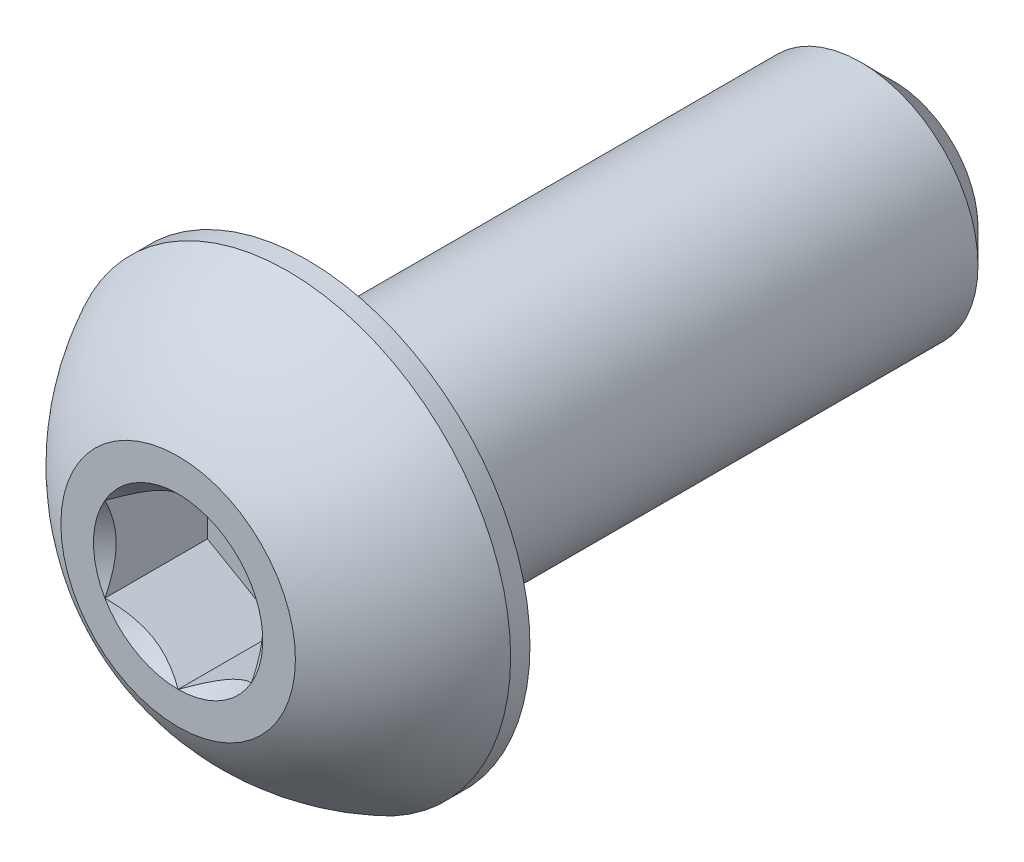
ISO-10303-21;
HEADER;
FILE_DESCRIPTION(('STEP AP214'),'2;1');
FILE_NAME('part.step','',(''),(''),'','','');
FILE_SCHEMA(('AUTOMOTIVE_DESIGN { 1 0 10303 214 1 1 1 1 }'));
ENDSEC;
DATA;
#1=APPLICATION_CONTEXT('core data for automotive mechanical design processes');
#2=APPLICATION_PROTOCOL_DEFINITION('international standard','automotive_design',2000,#1);
#3=PRODUCT_CONTEXT('',#1,'mechanical');
#4=PRODUCT('Part','Part','',(#3));
#5=PRODUCT_RELATED_PRODUCT_CATEGORY('part','',(#4));
#6=PRODUCT_DEFINITION_FORMATION('','',#4);
#7=PRODUCT_DEFINITION_CONTEXT('part definition',#1,'design');
#8=PRODUCT_DEFINITION('design','',#6,#7);
#9=PRODUCT_DEFINITION_SHAPE('','',#8);
#10=(LENGTH_UNIT() NAMED_UNIT(*) SI_UNIT(.MILLI.,.METRE.));
#11=(NAMED_UNIT(*) PLANE_ANGLE_UNIT() SI_UNIT($,.RADIAN.));
#12=(NAMED_UNIT(*) SI_UNIT($,.STERADIAN.) SOLID_ANGLE_UNIT());
#13=UNCERTAINTY_MEASURE_WITH_UNIT(LENGTH_MEASURE(1.E-05),#10,'distance_accuracy_value','');
#14=(GEOMETRIC_REPRESENTATION_CONTEXT(3) GLOBAL_UNCERTAINTY_ASSIGNED_CONTEXT((#13)) GLOBAL_UNIT_ASSIGNED_CONTEXT((#10,
#11,#12)) REPRESENTATION_CONTEXT('',''));
#15=CARTESIAN_POINT('',(0.,0.,0.));
#16=DIRECTION('',(0.,0.,1.));
#17=DIRECTION('',(1.,0.,0.));
#18=AXIS2_PLACEMENT_3D('',#15,#16,#17);
#19=CARTESIAN_POINT('',(0.,0.,-6.1));
#20=DIRECTION('',(0.,0.,1.));
#21=DIRECTION('',(0.,-1.,0.));
#22=AXIS2_PLACEMENT_3D('',#19,#20,#21);
#23=PLANE('',#22);
#24=CARTESIAN_POINT('',(0.,0.,-6.1));
#25=DIRECTION('',(0.,0.,1.));
#26=DIRECTION('',(0.,-1.,0.));
#27=AXIS2_PLACEMENT_3D('',#24,#25,#26);
#28=CIRCLE('',#27,1.44);
#29=CARTESIAN_POINT('',(0.,-1.44,-6.1));
#30=VERTEX_POINT('',#29);
#31=EDGE_CURVE('E11',#30,#30,#28,.T.);
#32=ORIENTED_EDGE('',*,*,#31,.F.);
#33=EDGE_LOOP('',(#32));
#34=FACE_BOUND('',#33,.T.);
#35=ADVANCED_FACE('F16',(#34),#23,.F.);
#36=CARTESIAN_POINT('',(0.,0.,-6.1));
#37=DIRECTION('',(0.,0.,1.));
#38=DIRECTION('',(0.,-1.,0.));
#39=AXIS2_PLACEMENT_3D('',#36,#37,#38);
#40=CONICAL_SURFACE('',#39,1.44,0.785398163397441);
#41=ORIENTED_EDGE('',*,*,#31,.T.);
#42=EDGE_LOOP('',(#41));
#43=FACE_BOUND('',#42,.T.);
#44=CARTESIAN_POINT('',(0.,0.,-5.54));
#45=DIRECTION('',(0.,0.,1.));
#46=DIRECTION('',(0.,-1.,0.));
#47=AXIS2_PLACEMENT_3D('',#44,#45,#46);
#48=CIRCLE('',#47,2.);
#49=CARTESIAN_POINT('',(0.,-2.,-5.54));
#50=VERTEX_POINT('',#49);
#51=EDGE_CURVE('E30',#50,#50,#48,.T.);
#52=ORIENTED_EDGE('',*,*,#51,.F.);
#53=EDGE_LOOP('',(#52));
#54=FACE_BOUND('',#53,.T.);
#55=ADVANCED_FACE('F266',(#43,#54),#40,.T.);
#56=CARTESIAN_POINT('',(0.,0.,6.1));
#57=DIRECTION('',(0.,0.,1.));
#58=DIRECTION('',(0.,-1.,0.));
#59=AXIS2_PLACEMENT_3D('',#56,#57,#58);
#60=CYLINDRICAL_SURFACE('',#59,2.);
#61=CARTESIAN_POINT('',(0.,0.,3.9));
#62=DIRECTION('',(0.,0.,-1.));
#63=DIRECTION('',(-1.,0.,0.));
#64=AXIS2_PLACEMENT_3D('',#61,#62,#63);
#65=CIRCLE('',#64,2.);
#66=CARTESIAN_POINT('',(-2.,0.,3.9));
#67=VERTEX_POINT('',#66);
#68=EDGE_CURVE('E150',#67,#67,#65,.T.);
#69=ORIENTED_EDGE('',*,*,#68,.T.);
#70=EDGE_LOOP('',(#69));
#71=FACE_BOUND('',#70,.T.);
#72=ORIENTED_EDGE('',*,*,#51,.T.);
#73=EDGE_LOOP('',(#72));
#74=FACE_BOUND('',#73,.T.);
#75=ADVANCED_FACE('F272',(#71,#74),#60,.T.);
#76=CARTESIAN_POINT('',(0.,-3.8,3.9));
#77=DIRECTION('',(0.,0.,-1.));
#78=DIRECTION('',(0.,-1.,0.));
#79=AXIS2_PLACEMENT_3D('',#76,#77,#78);
#80=PLANE('',#79);
#81=ORIENTED_EDGE('',*,*,#68,.F.);
#82=EDGE_LOOP('',(#81));
#83=FACE_BOUND('',#82,.T.);
#84=CARTESIAN_POINT('',(0.,0.,3.9));
#85=DIRECTION('',(0.,0.,1.));
#86=DIRECTION('',(0.,-1.,0.));
#87=AXIS2_PLACEMENT_3D('',#84,#85,#86);
#88=CIRCLE('',#87,3.8);
#89=CARTESIAN_POINT('',(0.,-3.8,3.9));
#90=VERTEX_POINT('',#89);
#91=EDGE_CURVE('E165',#90,#90,#88,.T.);
#92=ORIENTED_EDGE('',*,*,#91,.F.);
#93=EDGE_LOOP('',(#92));
#94=FACE_BOUND('',#93,.T.);
#95=ADVANCED_FACE('F443',(#83,#94),#80,.T.);
#96=CARTESIAN_POINT('',(1.25,0.721687836487032,4.35));
#97=DIRECTION('',(0.5,0.866025403784439,0.));
#98=DIRECTION('',(0.,0.,-1.));
#99=AXIS2_PLACEMENT_3D('',#96,#97,#98);
#100=PLANE('',#99);
#101=DIRECTION('',(0.,0.,1.));
#102=VECTOR('',#101,1.);
#103=CARTESIAN_POINT('',(1.25,0.721687836487032,4.35));
#104=LINE('',#103,#102);
#105=CARTESIAN_POINT('',(1.25,0.721687836487032,4.35));
#106=VERTEX_POINT('',#105);
#107=CARTESIAN_POINT('',(1.25,0.721687836487032,6.1));
#108=VERTEX_POINT('',#107);
#109=EDGE_CURVE('E172',#106,#108,#104,.T.);
#110=ORIENTED_EDGE('',*,*,#109,.T.);
#111=CARTESIAN_POINT('',(1.25,0.721687836487032,6.1));
#112=CARTESIAN_POINT('',(0.916560687278159,0.91419911344539,5.90748872304164));
#113=CARTESIAN_POINT('',(0.627302735621754,1.08120226969946,5.90662715507142));
#114=CARTESIAN_POINT('',(0.336432191070978,1.24913645689518,5.90576078391989));
#115=CARTESIAN_POINT('',(0.,1.44337567297406,6.1));
#116=B_SPLINE_CURVE_WITH_KNOTS('',2,(#111,#112,#113,#114,#115),.UNSPECIFIED.,.F.,.F.,(3,2,3),
(0.,0.5,1.),.UNSPECIFIED.);
#117=CARTESIAN_POINT('',(0.,1.44337567297406,6.1));
#118=VERTEX_POINT('',#117);
#119=EDGE_CURVE('E158',#108,#118,#116,.T.);
#120=ORIENTED_EDGE('',*,*,#119,.T.);
#121=DIRECTION('',(0.,0.,1.));
#122=VECTOR('',#121,1.);
#123=CARTESIAN_POINT('',(0.,1.44337567297406,4.35));
#124=LINE('',#123,#122);
#125=CARTESIAN_POINT('',(0.,1.44337567297406,4.35));
#126=VERTEX_POINT('',#125);
#127=EDGE_CURVE('E146',#126,#118,#124,.T.);
#128=ORIENTED_EDGE('',*,*,#127,.F.);
#129=DIRECTION('',(-0.866025403784439,0.5,0.));
#130=VECTOR('',#129,1.);
#131=CARTESIAN_POINT('',(1.25,0.721687836487032,4.35));
#132=LINE('',#131,#130);
#133=EDGE_CURVE('E141',#106,#126,#132,.T.);
#134=ORIENTED_EDGE('',*,*,#133,.F.);
#135=EDGE_LOOP('',(#110,#120,#128,#134));
#136=FACE_BOUND('',#135,.T.);
#137=ADVANCED_FACE('F18',(#136),#100,.F.);
#138=CARTESIAN_POINT('',(1.25,-0.721687836487032,4.35));
#139=DIRECTION('',(1.,0.,0.));
#140=DIRECTION('',(0.,-1.,0.));
#141=AXIS2_PLACEMENT_3D('',#138,#139,#140);
#142=PLANE('',#141);
#143=DIRECTION('',(0.,0.,1.));
#144=VECTOR('',#143,1.);
#145=CARTESIAN_POINT('',(1.25,-0.721687836487032,4.35));
#146=LINE('',#145,#144);
#147=CARTESIAN_POINT('',(1.25,-0.721687836487032,4.35));
#148=VERTEX_POINT('',#147);
#149=CARTESIAN_POINT('',(1.25,-0.721687836487033,6.1));
#150=VERTEX_POINT('',#149);
#151=EDGE_CURVE('E65',#148,#150,#146,.T.);
#152=ORIENTED_EDGE('',*,*,#151,.T.);
#153=CARTESIAN_POINT('',(1.25,-0.721687836487032,6.1));
#154=CARTESIAN_POINT('',(1.25,-0.53800867861928,6.00816042106613));
#155=CARTESIAN_POINT('',(1.25,-0.371515987727132,5.96066578692546));
#156=CARTESIAN_POINT('',(1.25,-0.182317900963498,5.90669408484771));
#157=CARTESIAN_POINT('',(1.25,7.86844095020892E-05,5.90662432950243));
#158=CARTESIAN_POINT('',(1.25,0.181409034916159,5.90655498192566));
#159=CARTESIAN_POINT('',(1.25,0.371670740916256,5.96070988390206));
#160=CARTESIAN_POINT('',(1.25,0.537520454680808,6.00791630909689));
#161=CARTESIAN_POINT('',(1.25,0.721687836487032,6.1));
#162=B_SPLINE_CURVE_WITH_KNOTS('',2,(#153,#154,#155,#156,#157,#158,#159,#160,#161),
.UNSPECIFIED.,.F.,.F.,(3,2,2,2,3),(0.,0.25,0.5,0.75,1.),.UNSPECIFIED.);
#163=EDGE_CURVE('E300',#150,#108,#162,.T.);
#164=ORIENTED_EDGE('',*,*,#163,.T.);
#165=ORIENTED_EDGE('',*,*,#109,.F.);
#166=DIRECTION('',(0.,1.,0.));
#167=VECTOR('',#166,1.);
#168=CARTESIAN_POINT('',(1.25,-0.721687836487032,4.35));
#169=LINE('',#168,#167);
#170=EDGE_CURVE('E142',#148,#106,#169,.T.);
#171=ORIENTED_EDGE('',*,*,#170,.F.);
#172=EDGE_LOOP('',(#152,#164,#165,#171));
#173=FACE_BOUND('',#172,.T.);
#174=ADVANCED_FACE('F280',(#173),#142,.F.);
#175=CARTESIAN_POINT('',(0.,-1.44337567297406,4.35));
#176=DIRECTION('',(0.5,-0.866025403784439,0.));
#177=DIRECTION('',(0.,0.,-1.));
#178=AXIS2_PLACEMENT_3D('',#175,#176,#177);
#179=PLANE('',#178);
#180=DIRECTION('',(0.,0.,1.));
#181=VECTOR('',#180,1.);
#182=CARTESIAN_POINT('',(0.,-1.44337567297406,4.35));
#183=LINE('',#182,#181);
#184=CARTESIAN_POINT('',(0.,-1.44337567297406,4.35));
#185=VERTEX_POINT('',#184);
#186=CARTESIAN_POINT('',(0.,-1.44337567297406,6.1));
#187=VERTEX_POINT('',#186);
#188=EDGE_CURVE('E82',#185,#187,#183,.T.);
#189=ORIENTED_EDGE('',*,*,#188,.T.);
#190=CARTESIAN_POINT('',(0.,-1.44337567297406,6.1));
#191=CARTESIAN_POINT('',(0.333439312720908,-1.25086439601624,5.90748872304218));
#192=CARTESIAN_POINT('',(0.622697264378245,-1.08386123976164,5.90662715507142));
#193=CARTESIAN_POINT('',(0.913567808928088,-0.915927052566456,5.90576078391935));
#194=CARTESIAN_POINT('',(1.25,-0.721687836487032,6.1));
#195=B_SPLINE_CURVE_WITH_KNOTS('',2,(#190,#191,#192,#193,#194),.UNSPECIFIED.,.F.,.F.,(3,2,3),
(0.,0.5,1.),.UNSPECIFIED.);
#196=EDGE_CURVE('E382',#187,#150,#195,.T.);
#197=ORIENTED_EDGE('',*,*,#196,.T.);
#198=ORIENTED_EDGE('',*,*,#151,.F.);
#199=DIRECTION('',(0.866025403784439,0.5,0.));
#200=VECTOR('',#199,1.);
#201=CARTESIAN_POINT('',(0.,-1.44337567297406,4.35));
#202=LINE('',#201,#200);
#203=EDGE_CURVE('E147',#185,#148,#202,.T.);
#204=ORIENTED_EDGE('',*,*,#203,.F.);
#205=EDGE_LOOP('',(#189,#197,#198,#204));
#206=FACE_BOUND('',#205,.T.);
#207=ADVANCED_FACE('F283',(#206),#179,.F.);
#208=CARTESIAN_POINT('',(-1.25,-0.721687836487032,4.35));
#209=DIRECTION('',(-0.5,-0.866025403784439,0.));
#210=DIRECTION('',(-0.866025403784439,0.5,0.));
#211=AXIS2_PLACEMENT_3D('',#208,#209,#210);
#212=PLANE('',#211);
#213=DIRECTION('',(0.,0.,1.));
#214=VECTOR('',#213,1.);
#215=CARTESIAN_POINT('',(-1.25,-0.721687836487032,4.35));
#216=LINE('',#215,#214);
#217=CARTESIAN_POINT('',(-1.25,-0.721687836487032,4.35));
#218=VERTEX_POINT('',#217);
#219=CARTESIAN_POINT('',(-1.25,-0.721687836487033,6.1));
#220=VERTEX_POINT('',#219);
#221=EDGE_CURVE('E338',#218,#220,#216,.T.);
#222=ORIENTED_EDGE('',*,*,#221,.T.);
#223=CARTESIAN_POINT('',(-1.25,-0.721687836487032,6.1));
#224=CARTESIAN_POINT('',(-0.916560687278155,-0.914199113445393,5.90748872304164));
#225=CARTESIAN_POINT('',(-0.627302735621754,-1.08120226969946,5.90662715507142));
#226=CARTESIAN_POINT('',(-0.336432191070971,-1.24913645689518,5.9057607839199));
#227=CARTESIAN_POINT('',(0.,-1.44337567297406,6.1));
#228=B_SPLINE_CURVE_WITH_KNOTS('',2,(#223,#224,#225,#226,#227),.UNSPECIFIED.,.F.,.F.,(3,2,3),
(0.,0.5,1.),.UNSPECIFIED.);
#229=EDGE_CURVE('E334',#220,#187,#228,.T.);
#230=ORIENTED_EDGE('',*,*,#229,.T.);
#231=ORIENTED_EDGE('',*,*,#188,.F.);
#232=DIRECTION('',(0.866025403784439,-0.5,0.));
#233=VECTOR('',#232,1.);
#234=CARTESIAN_POINT('',(-1.25,-0.721687836487032,4.35));
#235=LINE('',#234,#233);
#236=EDGE_CURVE('E151',#218,#185,#235,.T.);
#237=ORIENTED_EDGE('',*,*,#236,.F.);
#238=EDGE_LOOP('',(#222,#230,#231,#237));
#239=FACE_BOUND('',#238,.T.);
#240=ADVANCED_FACE('F215',(#239),#212,.F.);
#241=CARTESIAN_POINT('',(-1.25,0.721687836487033,4.35));
#242=DIRECTION('',(-1.,0.,0.));
#243=DIRECTION('',(0.,0.,1.));
#244=AXIS2_PLACEMENT_3D('',#241,#242,#243);
#245=PLANE('',#244);
#246=DIRECTION('',(0.,0.,1.));
#247=VECTOR('',#246,1.);
#248=CARTESIAN_POINT('',(-1.25,0.721687836487033,4.35));
#249=LINE('',#248,#247);
#250=CARTESIAN_POINT('',(-1.25,0.721687836487033,4.35));
#251=VERTEX_POINT('',#250);
#252=CARTESIAN_POINT('',(-1.25,0.721687836487033,6.1));
#253=VERTEX_POINT('',#252);
#254=EDGE_CURVE('E242',#251,#253,#249,.T.);
#255=ORIENTED_EDGE('',*,*,#254,.T.);
#256=CARTESIAN_POINT('',(-1.25,0.721687836487033,6.1));
#257=CARTESIAN_POINT('',(-1.25,0.538092414487825,6.0082022890004));
#258=CARTESIAN_POINT('',(-1.25,0.371670740916257,5.96070988390206));
#259=CARTESIAN_POINT('',(-1.25,0.182469151636589,5.90671668499666));
#260=CARTESIAN_POINT('',(-1.25,7.86844095019808E-05,5.90662432950243));
#261=CARTESIAN_POINT('',(-1.25,-0.18125671000327,5.90653250825636));
#262=CARTESIAN_POINT('',(-1.25,-0.371515987727133,5.96066578692546));
#263=CARTESIAN_POINT('',(-1.25,-0.537435467855679,6.00787381568433));
#264=CARTESIAN_POINT('',(-1.25,-0.721687836487033,6.1));
#265=B_SPLINE_CURVE_WITH_KNOTS('',2,(#256,#257,#258,#259,#260,#261,#262,#263,#264),
.UNSPECIFIED.,.F.,.F.,(3,2,2,2,3),(0.,0.25,0.5,0.75,1.),.UNSPECIFIED.);
#266=EDGE_CURVE('E236',#253,#220,#265,.T.);
#267=ORIENTED_EDGE('',*,*,#266,.T.);
#268=ORIENTED_EDGE('',*,*,#221,.F.);
#269=DIRECTION('',(0.,-1.,0.));
#270=VECTOR('',#269,1.);
#271=CARTESIAN_POINT('',(-1.25,0.721687836487033,4.35));
#272=LINE('',#271,#270);
#273=EDGE_CURVE('E140',#251,#218,#272,.T.);
#274=ORIENTED_EDGE('',*,*,#273,.F.);
#275=EDGE_LOOP('',(#255,#267,#268,#274));
#276=FACE_BOUND('',#275,.T.);
#277=ADVANCED_FACE('F210',(#276),#245,.F.);
#278=CARTESIAN_POINT('',(0.,1.44337567297406,4.35));
#279=DIRECTION('',(-0.5,0.866025403784439,0.));
#280=DIRECTION('',(0.,0.,1.));
#281=AXIS2_PLACEMENT_3D('',#278,#279,#280);
#282=PLANE('',#281);
#283=ORIENTED_EDGE('',*,*,#127,.T.);
#284=CARTESIAN_POINT('',(0.,1.44337567297406,6.1));
#285=CARTESIAN_POINT('',(-0.333439312721378,1.25086439601597,5.90748872304191));
#286=CARTESIAN_POINT('',(-0.622697264378245,1.08386123976164,5.90662715507142));
#287=CARTESIAN_POINT('',(-0.913567808928559,0.915927052566184,5.90576078391963));
#288=CARTESIAN_POINT('',(-1.25,0.721687836487032,6.1));
#289=B_SPLINE_CURVE_WITH_KNOTS('',2,(#284,#285,#286,#287,#288),.UNSPECIFIED.,.F.,.F.,(3,2,3),
(0.,0.5,1.),.UNSPECIFIED.);
#290=EDGE_CURVE('E422',#118,#253,#289,.T.);
#291=ORIENTED_EDGE('',*,*,#290,.T.);
#292=ORIENTED_EDGE('',*,*,#254,.F.);
#293=DIRECTION('',(-0.866025403784439,-0.5,0.));
#294=VECTOR('',#293,1.);
#295=CARTESIAN_POINT('',(0.,1.44337567297406,4.35));
#296=LINE('',#295,#294);
#297=EDGE_CURVE('E136',#126,#251,#296,.T.);
#298=ORIENTED_EDGE('',*,*,#297,.F.);
#299=EDGE_LOOP('',(#283,#291,#292,#298));
#300=FACE_BOUND('',#299,.T.);
#301=ADVANCED_FACE('F214',(#300),#282,.F.);
#302=CARTESIAN_POINT('',(0.,0.,4.35));
#303=DIRECTION('',(0.,0.,1.));
#304=DIRECTION('',(1.,0.,0.));
#305=AXIS2_PLACEMENT_3D('',#302,#303,#304);
#306=PLANE('',#305);
#307=ORIENTED_EDGE('',*,*,#133,.T.);
#308=ORIENTED_EDGE('',*,*,#297,.T.);
#309=ORIENTED_EDGE('',*,*,#273,.T.);
#310=ORIENTED_EDGE('',*,*,#236,.T.);
#311=ORIENTED_EDGE('',*,*,#203,.T.);
#312=ORIENTED_EDGE('',*,*,#170,.T.);
#313=EDGE_LOOP('',(#307,#308,#309,#310,#311,#312));
#314=FACE_BOUND('',#313,.T.);
#315=ADVANCED_FACE('F207',(#314),#306,.T.);
#316=CARTESIAN_POINT('',(0.,0.,6.1));
#317=DIRECTION('',(0.,0.,1.));
#318=DIRECTION('',(1.,0.,0.));
#319=AXIS2_PLACEMENT_3D('',#316,#317,#318);
#320=CONICAL_SURFACE('',#319,1.44337567297406,0.78539816339745);
#321=CARTESIAN_POINT('',(0.,0.,6.1));
#322=DIRECTION('',(0.,0.,1.));
#323=DIRECTION('',(1.,0.,0.));
#324=AXIS2_PLACEMENT_3D('',#321,#322,#323);
#325=CIRCLE('',#324,1.44337567297406);
#326=EDGE_CURVE('E132',#108,#118,#325,.T.);
#327=ORIENTED_EDGE('',*,*,#326,.T.);
#328=ORIENTED_EDGE('',*,*,#119,.F.);
#329=EDGE_LOOP('',(#327,#328));
#330=FACE_BOUND('',#329,.T.);
#331=ADVANCED_FACE('F196',(#330),#320,.F.);
#332=CARTESIAN_POINT('',(0.,0.,6.1));
#333=DIRECTION('',(0.,0.,1.));
#334=DIRECTION('',(1.,0.,0.));
#335=AXIS2_PLACEMENT_3D('',#332,#333,#334);
#336=CONICAL_SURFACE('',#335,1.44337567297406,0.78539816339745);
#337=CARTESIAN_POINT('',(0.,0.,6.1));
#338=DIRECTION('',(0.,0.,1.));
#339=DIRECTION('',(1.,0.,0.));
#340=AXIS2_PLACEMENT_3D('',#337,#338,#339);
#341=CIRCLE('',#340,1.44337567297406);
#342=EDGE_CURVE('E363',#150,#108,#341,.T.);
#343=ORIENTED_EDGE('',*,*,#342,.T.);
#344=ORIENTED_EDGE('',*,*,#163,.F.);
#345=EDGE_LOOP('',(#343,#344));
#346=FACE_BOUND('',#345,.T.);
#347=ADVANCED_FACE('F206',(#346),#336,.F.);
#348=CARTESIAN_POINT('',(0.,0.,6.1));
#349=DIRECTION('',(0.,0.,1.));
#350=DIRECTION('',(1.,0.,0.));
#351=AXIS2_PLACEMENT_3D('',#348,#349,#350);
#352=CONICAL_SURFACE('',#351,1.44337567297406,0.78539816339745);
#353=CARTESIAN_POINT('',(0.,0.,6.1));
#354=DIRECTION('',(0.,0.,1.));
#355=DIRECTION('',(1.,0.,0.));
#356=AXIS2_PLACEMENT_3D('',#353,#354,#355);
#357=CIRCLE('',#356,1.44337567297406);
#358=EDGE_CURVE('E356',#187,#150,#357,.T.);
#359=ORIENTED_EDGE('',*,*,#358,.T.);
#360=ORIENTED_EDGE('',*,*,#196,.F.);
#361=EDGE_LOOP('',(#359,#360));
#362=FACE_BOUND('',#361,.T.);
#363=ADVANCED_FACE('F217',(#362),#352,.F.);
#364=CARTESIAN_POINT('',(0.,0.,6.1));
#365=DIRECTION('',(0.,0.,1.));
#366=DIRECTION('',(1.,0.,0.));
#367=AXIS2_PLACEMENT_3D('',#364,#365,#366);
#368=CONICAL_SURFACE('',#367,1.44337567297406,0.78539816339745);
#369=CARTESIAN_POINT('',(0.,0.,6.1));
#370=DIRECTION('',(0.,0.,1.));
#371=DIRECTION('',(1.,0.,0.));
#372=AXIS2_PLACEMENT_3D('',#369,#370,#371);
#373=CIRCLE('',#372,1.44337567297406);
#374=EDGE_CURVE('E349',#220,#187,#373,.T.);
#375=ORIENTED_EDGE('',*,*,#374,.T.);
#376=ORIENTED_EDGE('',*,*,#229,.F.);
#377=EDGE_LOOP('',(#375,#376));
#378=FACE_BOUND('',#377,.T.);
#379=ADVANCED_FACE('F208',(#378),#368,.F.);
#380=CARTESIAN_POINT('',(0.,0.,6.1));
#381=DIRECTION('',(0.,0.,1.));
#382=DIRECTION('',(1.,0.,0.));
#383=AXIS2_PLACEMENT_3D('',#380,#381,#382);
#384=CONICAL_SURFACE('',#383,1.44337567297406,0.78539816339745);
#385=CARTESIAN_POINT('',(0.,0.,6.1));
#386=DIRECTION('',(0.,0.,1.));
#387=DIRECTION('',(1.,0.,0.));
#388=AXIS2_PLACEMENT_3D('',#385,#386,#387);
#389=CIRCLE('',#388,1.44337567297406);
#390=EDGE_CURVE('E166',#253,#220,#389,.T.);
#391=ORIENTED_EDGE('',*,*,#390,.T.);
#392=ORIENTED_EDGE('',*,*,#266,.F.);
#393=EDGE_LOOP('',(#391,#392));
#394=FACE_BOUND('',#393,.T.);
#395=ADVANCED_FACE('F244',(#394),#384,.F.);
#396=CARTESIAN_POINT('',(0.,0.,6.1));
#397=DIRECTION('',(0.,0.,1.));
#398=DIRECTION('',(1.,0.,0.));
#399=AXIS2_PLACEMENT_3D('',#396,#397,#398);
#400=CONICAL_SURFACE('',#399,1.44337567297406,0.78539816339745);
#401=CARTESIAN_POINT('',(0.,0.,6.1));
#402=DIRECTION('',(0.,0.,1.));
#403=DIRECTION('',(1.,0.,0.));
#404=AXIS2_PLACEMENT_3D('',#401,#402,#403);
#405=CIRCLE('',#404,1.44337567297406);
#406=EDGE_CURVE('E125',#118,#253,#405,.T.);
#407=ORIENTED_EDGE('',*,*,#406,.T.);
#408=ORIENTED_EDGE('',*,*,#290,.F.);
#409=EDGE_LOOP('',(#407,#408));
#410=FACE_BOUND('',#409,.T.);
#411=ADVANCED_FACE('F253',(#410),#400,.F.);
#412=CARTESIAN_POINT('',(0.,0.,6.1));
#413=DIRECTION('',(0.,0.,1.));
#414=DIRECTION('',(0.,-1.,0.));
#415=AXIS2_PLACEMENT_3D('',#412,#413,#414);
#416=CYLINDRICAL_SURFACE('',#415,3.8);
#417=CARTESIAN_POINT('',(0.,0.,4.23));
#418=DIRECTION('',(0.,0.,1.));
#419=DIRECTION('',(0.,-1.,0.));
#420=AXIS2_PLACEMENT_3D('',#417,#418,#419);
#421=CIRCLE('',#420,3.8);
#422=CARTESIAN_POINT('',(0.,-3.8,4.23));
#423=VERTEX_POINT('',#422);
#424=EDGE_CURVE('E162',#423,#423,#421,.T.);
#425=ORIENTED_EDGE('',*,*,#424,.F.);
#426=EDGE_LOOP('',(#425));
#427=FACE_BOUND('',#426,.T.);
#428=ORIENTED_EDGE('',*,*,#91,.T.);
#429=EDGE_LOOP('',(#428));
#430=FACE_BOUND('',#429,.T.);
#431=ADVANCED_FACE('F254',(#427,#430),#416,.T.);
#432=CARTESIAN_POINT('',(0.,0.,2.37355614973261));
#433=DIRECTION('',(-1.,0.,0.));
#434=DIRECTION('',(0.,1.,0.));
#435=AXIS2_PLACEMENT_3D('',#432,#433,#434);
#436=SPHERICAL_SURFACE('',#435,4.22922968981298);
#437=CARTESIAN_POINT('',(0.,0.,2.37355614973261));
#438=DIRECTION('',(0.,0.,1.));
#439=DIRECTION('',(0.,-1.,0.));
#440=AXIS2_PLACEMENT_3D('',#437,#438,#439);
#441=SPHERICAL_SURFACE('',#440,4.22922968981298);
#442=CARTESIAN_POINT('',(0.,0.,6.1));
#443=DIRECTION('',(0.,0.,1.));
#444=DIRECTION('',(0.,-1.,0.));
#445=AXIS2_PLACEMENT_3D('',#442,#443,#444);
#446=CIRCLE('',#445,2.);
#447=CARTESIAN_POINT('',(0.,-2.,6.1));
#448=VERTEX_POINT('',#447);
#449=EDGE_CURVE('E121',#448,#448,#446,.T.);
#450=ORIENTED_EDGE('',*,*,#449,.F.);
#451=EDGE_LOOP('',(#450));
#452=FACE_BOUND('',#451,.T.);
#453=ORIENTED_EDGE('',*,*,#424,.T.);
#454=EDGE_LOOP('',(#453));
#455=FACE_BOUND('',#454,.T.);
#456=ADVANCED_FACE('F263',(#452,#455),#441,.T.);
#457=CARTESIAN_POINT('',(0.,0.,6.1));
#458=DIRECTION('',(0.,0.,-1.));
#459=DIRECTION('',(0.,-1.,0.));
#460=AXIS2_PLACEMENT_3D('',#457,#458,#459);
#461=PLANE('',#460);
#462=ORIENTED_EDGE('',*,*,#406,.F.);
#463=ORIENTED_EDGE('',*,*,#326,.F.);
#464=ORIENTED_EDGE('',*,*,#342,.F.);
#465=ORIENTED_EDGE('',*,*,#358,.F.);
#466=ORIENTED_EDGE('',*,*,#374,.F.);
#467=ORIENTED_EDGE('',*,*,#390,.F.);
#468=EDGE_LOOP('',(#462,#463,#464,#465,#466,#467));
#469=FACE_BOUND('',#468,.T.);
#470=ORIENTED_EDGE('',*,*,#449,.T.);
#471=EDGE_LOOP('',(#470));
#472=FACE_BOUND('',#471,.T.);
#473=ADVANCED_FACE('F122',(#469,#472),#461,.F.);
#474=CLOSED_SHELL('',(#35,#55,#75,#95,#137,#174,#207,#240,#277,#301,#315,#331,#347,#363,#379,
#395,#411,#431,#456,#473));
#475=MANIFOLD_SOLID_BREP('B1',#474);
#476=ADVANCED_BREP_SHAPE_REPRESENTATION('',(#18,#475),#14);
#477=SHAPE_DEFINITION_REPRESENTATION(#9,#476);
ENDSEC;
END-ISO-10303-21;
